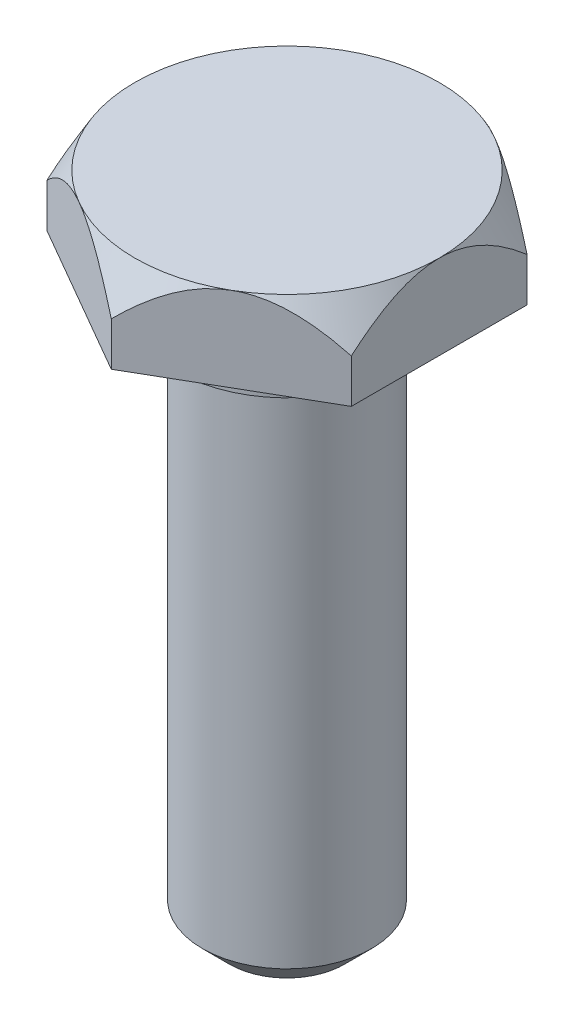
ISO-10303-21;
HEADER;
FILE_DESCRIPTION(('STEP AP214'),'2;1');
FILE_NAME('part.step','',(''),(''),'','','');
FILE_SCHEMA(('AUTOMOTIVE_DESIGN { 1 0 10303 214 1 1 1 1 }'));
ENDSEC;
DATA;
#1=APPLICATION_CONTEXT('core data for automotive mechanical design processes');
#2=APPLICATION_PROTOCOL_DEFINITION('international standard','automotive_design',2000,#1);
#3=PRODUCT_CONTEXT('',#1,'mechanical');
#4=PRODUCT('Part','Part','',(#3));
#5=PRODUCT_RELATED_PRODUCT_CATEGORY('part','',(#4));
#6=PRODUCT_DEFINITION_FORMATION('','',#4);
#7=PRODUCT_DEFINITION_CONTEXT('part definition',#1,'design');
#8=PRODUCT_DEFINITION('design','',#6,#7);
#9=PRODUCT_DEFINITION_SHAPE('','',#8);
#10=(LENGTH_UNIT() NAMED_UNIT(*) SI_UNIT(.MILLI.,.METRE.));
#11=(NAMED_UNIT(*) PLANE_ANGLE_UNIT() SI_UNIT($,.RADIAN.));
#12=(NAMED_UNIT(*) SI_UNIT($,.STERADIAN.) SOLID_ANGLE_UNIT());
#13=UNCERTAINTY_MEASURE_WITH_UNIT(LENGTH_MEASURE(1.E-05),#10,'distance_accuracy_value','');
#14=(GEOMETRIC_REPRESENTATION_CONTEXT(3) GLOBAL_UNCERTAINTY_ASSIGNED_CONTEXT((#13)) GLOBAL_UNIT_ASSIGNED_CONTEXT((#10,
#11,#12)) REPRESENTATION_CONTEXT('',''));
#15=CARTESIAN_POINT('',(0.,0.,0.));
#16=DIRECTION('',(0.,0.,1.));
#17=DIRECTION('',(1.,0.,0.));
#18=AXIS2_PLACEMENT_3D('',#15,#16,#17);
#19=CARTESIAN_POINT('',(0.,-16.,-5.2));
#20=DIRECTION('',(0.499999999999998,0.,-0.86602540378444));
#21=DIRECTION('',(-0.86602540378444,0.,-0.499999999999998));
#22=AXIS2_PLACEMENT_3D('',#19,#20,#21);
#23=PLANE('',#22);
#24=DIRECTION('',(0.,1.,0.));
#25=VECTOR('',#24,1.);
#26=CARTESIAN_POINT('',(0.,-16.,-5.2));
#27=LINE('',#26,#25);
#28=CARTESIAN_POINT('',(0.,1.,-5.2));
#29=VERTEX_POINT('',#28);
#30=CARTESIAN_POINT('',(0.,2.29333580064184,-5.2));
#31=VERTEX_POINT('',#30);
#32=EDGE_CURVE('E143',#29,#31,#27,.T.);
#33=ORIENTED_EDGE('',*,*,#32,.T.);
#34=CARTESIAN_POINT('',(-0.0002,2.29313579398026,-5.20011547005384));
#35=CARTESIAN_POINT('',(0.0469011403824495,2.34023524499869,-5.1729216139749));
#36=CARTESIAN_POINT('',(0.0944722532751612,2.38670654099836,-5.14545641914064));
#37=CARTESIAN_POINT('',(0.190657869442315,2.47821771462454,-5.08992362775436));
#38=CARTESIAN_POINT('',(0.239272666450655,2.52325718018994,-5.061855861615));
#39=CARTESIAN_POINT('',(0.387297987657652,2.65637555293229,-4.97639340256926));
#40=CARTESIAN_POINT('',(0.48841148853874,2.74197068548027,-4.91801549561686));
#41=CARTESIAN_POINT('',(0.698509846250297,2.9065014835554,-4.79671515223579));
#42=CARTESIAN_POINT('',(0.807630576530103,2.98520795102576,-4.73371426923458));
#43=CARTESIAN_POINT('',(1.0317833611979,3.13007672622558,-4.60429959866702));
#44=CARTESIAN_POINT('',(1.14680161058769,3.19626676863727,-4.53789378142011));
#45=CARTESIAN_POINT('',(1.32909810741186,3.2856990070475,-4.43264484990635));
#46=CARTESIAN_POINT('',(1.39424234400745,3.31476608307449,-4.39503380737173));
#47=CARTESIAN_POINT('',(1.52623706753496,3.36726637932291,-4.31882661821152));
#48=CARTESIAN_POINT('',(1.5930876817994,3.39069917773839,-4.28023039807045));
#49=CARTESIAN_POINT('',(1.72769745912124,3.43103513854391,-4.20251340689813));
#50=CARTESIAN_POINT('',(1.79544524039845,3.44798852317885,-4.16339920714073));
#51=CARTESIAN_POINT('',(1.9319604536706,3.4750140875619,-4.08458211200958));
#52=CARTESIAN_POINT('',(2.00072769243193,3.48508755475139,-4.0448793281993));
#53=CARTESIAN_POINT('',(2.13941405326446,3.49801046531967,-3.9648087204397));
#54=CARTESIAN_POINT('',(2.20933795033535,3.50079247425805,-3.92443813964304));
#55=CARTESIAN_POINT('',(2.34910351754793,3.49881816618163,-3.84374445178942));
#56=CARTESIAN_POINT('',(2.41894518797228,3.49406187515646,-3.80342134456926));
#57=CARTESIAN_POINT('',(2.55810932173049,3.47719372164936,-3.72307489448243));
#58=CARTESIAN_POINT('',(2.62743032360903,3.46506586739329,-3.68305239538735));
#59=CARTESIAN_POINT('',(2.76491952502245,3.43393384069037,-3.60367296794065));
#60=CARTESIAN_POINT('',(2.83308700456767,3.41492552820866,-3.56431645527524));
#61=CARTESIAN_POINT('',(3.07412414242066,3.33578563381507,-3.42515359885112));
#62=CARTESIAN_POINT('',(3.24278748842878,3.25803983342103,-3.32777577063091));
#63=CARTESIAN_POINT('',(3.48636672248926,3.1199467145914,-3.18714523427709));
#64=CARTESIAN_POINT('',(3.56619005899107,3.07017543869227,-3.14105920946016));
#65=CARTESIAN_POINT('',(3.72288991210024,2.96475393740493,-3.0505885070856));
#66=CARTESIAN_POINT('',(3.79976691072227,2.90910467928571,-3.00620355123668));
#67=CARTESIAN_POINT('',(3.98593589033841,2.766016402118,-2.89871884074055));
#68=CARTESIAN_POINT('',(4.09364349530401,2.67584560008324,-2.83653382601989));
#69=CARTESIAN_POINT('',(4.25076304037691,2.53547211986548,-2.7458208143771));
#70=CARTESIAN_POINT('',(4.30211777868526,2.48811006848886,-2.71617114239061));
#71=CARTESIAN_POINT('',(4.40366614430005,2.39177691558692,-2.65754216616715));
#72=CARTESIAN_POINT('',(4.45386000936567,2.34280614860675,-2.62856272465984));
#73=CARTESIAN_POINT('',(4.50353209967907,2.29313579398026,-2.59988452994619));
#74=B_SPLINE_CURVE_WITH_KNOTS('',3,(#34,#35,#36,#37,#38,#39,#40,#41,#42,#43,#44,#45,#46,#47,#48,
#49,#50,#51,#52,#53,#54,#55,#56,#57,#58,#59,#60,#61,#62,#63,#64,#65,#66,#67,#68,#69,#70,#71,#72,
#73),.UNSPECIFIED.,.F.,.F.,(4,2,2,2,2,2,2,2,2,2,2,2,2,2,2,2,2,2,2,4),(0.,0.215831451732362,
0.43172446461581,0.865709276716572,1.31090688893008,1.7551061380637,1.9968514743985,
2.23861490318487,2.4784644534946,2.71826910836671,2.96028387577228,3.20229780879056,
3.44483864694657,3.68752566741079,4.31247626233517,4.62662636660601,4.94072485526679,
5.40115685591737,5.62881219046212,5.85642047830151),.UNSPECIFIED.);
#75=CARTESIAN_POINT('',(2.25166604983953,3.5,-3.90000000000002));
#76=VERTEX_POINT('',#75);
#77=EDGE_CURVE('E146',#31,#76,#74,.T.);
#78=ORIENTED_EDGE('',*,*,#77,.T.);
#79=CARTESIAN_POINT('',(4.50333209967907,2.29333580064185,-2.60000000000002));
#80=VERTEX_POINT('',#79);
#81=EDGE_CURVE('E237',#76,#80,#74,.T.);
#82=ORIENTED_EDGE('',*,*,#81,.T.);
#83=DIRECTION('',(0.,1.,0.));
#84=VECTOR('',#83,1.);
#85=CARTESIAN_POINT('',(4.50333209967907,-16.,-2.60000000000003));
#86=LINE('',#85,#84);
#87=CARTESIAN_POINT('',(4.50333209967907,1.,-2.60000000000003));
#88=VERTEX_POINT('',#87);
#89=EDGE_CURVE('E134',#88,#80,#86,.T.);
#90=ORIENTED_EDGE('',*,*,#89,.F.);
#91=DIRECTION('',(-0.86602540378444,0.,-0.499999999999998));
#92=VECTOR('',#91,1.);
#93=CARTESIAN_POINT('',(6.15166604983955,1.,-1.64833395016048));
#94=LINE('',#93,#92);
#95=EDGE_CURVE('E168',#88,#29,#94,.T.);
#96=ORIENTED_EDGE('',*,*,#95,.T.);
#97=EDGE_LOOP('',(#33,#78,#82,#90,#96));
#98=FACE_BOUND('',#97,.T.);
#99=ADVANCED_FACE('F39',(#98),#23,.T.);
#100=CARTESIAN_POINT('',(4.50333209967907,-16.,-2.60000000000003));
#101=DIRECTION('',(1.,0.,0.));
#102=DIRECTION('',(0.,0.,-1.));
#103=AXIS2_PLACEMENT_3D('',#100,#101,#102);
#104=PLANE('',#103);
#105=ORIENTED_EDGE('',*,*,#89,.T.);
#106=CARTESIAN_POINT('',(4.50333209967907,0.216415563066361,-4.54627481097209));
#107=CARTESIAN_POINT('',(4.50333209967907,0.332457435983913,-4.4519528110691));
#108=CARTESIAN_POINT('',(4.50333209967907,0.447813588029783,-4.35677427733934));
#109=CARTESIAN_POINT('',(4.50333209967907,0.676857424368945,-4.16437109343592));
#110=CARTESIAN_POINT('',(4.50333209967907,0.790544655913492,-4.0671459048367));
#111=CARTESIAN_POINT('',(4.50333209967907,1.01694330237538,-3.86944777842779));
#112=CARTESIAN_POINT('',(4.50333209967907,1.12963569947896,-3.7689529945554));
#113=CARTESIAN_POINT('',(4.50333209967907,1.35247917796968,-3.56519775873801));
#114=CARTESIAN_POINT('',(4.50333209967907,1.46263049747441,-3.46193756790757));
#115=CARTESIAN_POINT('',(4.50333209967907,1.68685978340291,-3.24533263391641));
#116=CARTESIAN_POINT('',(4.50333209967907,1.80072709966915,-3.13176882767578));
#117=CARTESIAN_POINT('',(4.50333209967907,2.02392937674397,-2.90018841253913));
#118=CARTESIAN_POINT('',(4.50333209967907,2.13326317518252,-2.78217067631432));
#119=CARTESIAN_POINT('',(4.50333209967907,2.34553429974651,-2.54129878449501));
#120=CARTESIAN_POINT('',(4.50333209967907,2.44849485770499,-2.41846523258464));
#121=CARTESIAN_POINT('',(4.50333209967907,2.64643137681666,-2.16656866624975));
#122=CARTESIAN_POINT('',(4.50333209967907,2.74141276100902,-2.03750997819506));
#123=CARTESIAN_POINT('',(4.50333209967907,2.88957616033856,-1.81790841351126));
#124=CARTESIAN_POINT('',(4.50333209967907,2.94586169475161,-1.72946454076314));
#125=CARTESIAN_POINT('',(4.50333209967907,3.05271330260479,-1.54911809151349));
#126=CARTESIAN_POINT('',(4.50333209967907,3.10327750474313,-1.45721439641566));
#127=CARTESIAN_POINT('',(4.50333209967907,3.1968818280516,-1.27071575109596));
#128=CARTESIAN_POINT('',(4.50333209967907,3.23998963047388,-1.17615518164546));
#129=CARTESIAN_POINT('',(4.50333209967907,3.31774372780694,-0.983653372939059));
#130=CARTESIAN_POINT('',(4.50333209967907,3.35239392816319,-0.885713717972165));
#131=CARTESIAN_POINT('',(4.50333209967907,3.42562431036837,-0.639773318486418));
#132=CARTESIAN_POINT('',(4.50333209967907,3.4583555040521,-0.489940205042256));
#133=CARTESIAN_POINT('',(4.50333209967907,3.4976639657297,-0.186848054091008));
#134=CARTESIAN_POINT('',(4.50333209967907,3.50425478200046,-0.0335908326950485));
#135=CARTESIAN_POINT('',(4.50333209967907,3.49029871500567,0.2716108155052));
#136=CARTESIAN_POINT('',(4.50333209967907,3.46975562400885,0.423555422774915));
#137=CARTESIAN_POINT('',(4.50333209967907,3.40453838787359,0.722136421375482));
#138=CARTESIAN_POINT('',(4.50333209967907,3.35984066908559,0.868767477537573));
#139=CARTESIAN_POINT('',(4.50333209967907,3.26263156711168,1.12487551120467));
#140=CARTESIAN_POINT('',(4.50333209967907,3.213665932093,1.23574866951839));
#141=CARTESIAN_POINT('',(4.50333209967907,3.10613993306368,1.4527900357204));
#142=CARTESIAN_POINT('',(4.50333209967907,3.04757301353044,1.55895496557891));
#143=CARTESIAN_POINT('',(4.50333209967907,2.92223577027134,1.76786853481869));
#144=CARTESIAN_POINT('',(4.50333209967907,2.85538199568495,1.87056649920331));
#145=CARTESIAN_POINT('',(4.50333209967907,2.71569050022903,2.07169900658316));
#146=CARTESIAN_POINT('',(4.50333209967907,2.64285569739026,2.17013559324337));
#147=CARTESIAN_POINT('',(4.50333209967907,2.48589521153302,2.37169646129933));
#148=CARTESIAN_POINT('',(4.50333209967907,2.40133854632997,2.47448316614205));
#149=CARTESIAN_POINT('',(4.50333209967907,2.22781834998086,2.67628382740557));
#150=CARTESIAN_POINT('',(4.50333209967907,2.13885379161291,2.77529689481055));
#151=CARTESIAN_POINT('',(4.50333209967907,1.95734298235729,2.97015736204481));
#152=CARTESIAN_POINT('',(4.50333209967907,1.86479319653053,3.06600145545047));
#153=CARTESIAN_POINT('',(4.50333209967907,1.67686088419095,3.2548779447157));
#154=CARTESIAN_POINT('',(4.50333209967907,1.58147807333761,3.34791005644325));
#155=CARTESIAN_POINT('',(4.50333209967907,1.29087393083653,3.62433701112674));
#156=CARTESIAN_POINT('',(4.50333209967907,1.09215510201806,3.80405474674387));
#157=CARTESIAN_POINT('',(4.50333209967907,0.68830284544034,4.15612387766858));
#158=CARTESIAN_POINT('',(4.50333209967907,0.483168230568449,4.32847389559694));
#159=CARTESIAN_POINT('',(4.50333209967907,0.0889657259078814,4.65052616958507));
#160=CARTESIAN_POINT('',(4.50333209967907,-0.0996604953356007,4.80077112390493));
#161=CARTESIAN_POINT('',(4.50333209967907,-0.479853962026363,5.0975433877512));
#162=CARTESIAN_POINT('',(4.50333209967907,-0.671421661648393,5.24407011371387));
#163=CARTESIAN_POINT('',(4.50333209967907,-1.05445847145293,5.53226888747017));
#164=CARTESIAN_POINT('',(4.50333209967907,-1.24589931149069,5.67397861307399));
#165=CARTESIAN_POINT('',(4.50333209967907,-1.63055330544533,5.954859651152));
#166=CARTESIAN_POINT('',(4.50333209967907,-1.82376594562147,6.09403166652092));
#167=CARTESIAN_POINT('',(4.50333209967907,-2.01768663979484,6.2321953712361));
#168=B_SPLINE_CURVE_WITH_KNOTS('',3,(#106,#107,#108,#109,#110,#111,#112,#113,#114,#115,#116,
#117,#118,#119,#120,#121,#122,#123,#124,#125,#126,#127,#128,#129,#130,#131,#132,#133,#134,#135,
#136,#137,#138,#139,#140,#141,#142,#143,#144,#145,#146,#147,#148,#149,#150,#151,#152,#153,#154,
#155,#156,#157,#158,#159,#160,#161,#162,#163,#164,#165,#166,#167),.UNSPECIFIED.,.F.,.F.,(4,2,2,
2,2,2,2,2,2,2,2,2,2,2,2,2,2,2,2,2,2,2,2,2,2,2,2,2,2,2,4),(0.,0.448629508234905,
0.897378552695795,1.35031690226502,1.80321263435101,2.2855680565207,2.76804639685374,
3.24864754794894,3.7289193707119,4.04325302369259,4.35768919180466,4.66910149058682,
4.98036971609446,5.43838802802684,5.89616892294186,6.35388584459722,6.81205028283173,
7.17514739625493,7.53849346402001,7.90585210848298,8.27303257846788,8.6721677668132,
9.07139641176278,9.47102923792133,9.8707023102328,10.674214751898,11.477876757396,
12.2012694155515,12.9247749142729,13.6393031608499,14.3536303953537),.UNSPECIFIED.);
#169=CARTESIAN_POINT('',(4.50333209967909,3.5,0.));
#170=VERTEX_POINT('',#169);
#171=EDGE_CURVE('E244',#80,#170,#168,.T.);
#172=ORIENTED_EDGE('',*,*,#171,.T.);
#173=CARTESIAN_POINT('',(4.50333209967906,2.29333580064185,2.60000000000003));
#174=VERTEX_POINT('',#173);
#175=EDGE_CURVE('E55',#170,#174,#168,.T.);
#176=ORIENTED_EDGE('',*,*,#175,.T.);
#177=DIRECTION('',(0.,1.,0.));
#178=VECTOR('',#177,1.);
#179=CARTESIAN_POINT('',(4.50333209967907,-16.,2.60000000000003));
#180=LINE('',#179,#178);
#181=CARTESIAN_POINT('',(4.50333209967907,1.,2.60000000000003));
#182=VERTEX_POINT('',#181);
#183=EDGE_CURVE('E131',#182,#174,#180,.T.);
#184=ORIENTED_EDGE('',*,*,#183,.F.);
#185=DIRECTION('',(0.,0.,-1.));
#186=VECTOR('',#185,1.);
#187=CARTESIAN_POINT('',(4.50333209967907,1.,0.));
#188=LINE('',#187,#186);
#189=EDGE_CURVE('E167',#182,#88,#188,.T.);
#190=ORIENTED_EDGE('',*,*,#189,.T.);
#191=EDGE_LOOP('',(#105,#172,#176,#184,#190));
#192=FACE_BOUND('',#191,.T.);
#193=ADVANCED_FACE('F233',(#192),#104,.T.);
#194=CARTESIAN_POINT('',(4.50333209967907,-16.,2.60000000000003));
#195=DIRECTION('',(0.499999999999998,0.,0.86602540378444));
#196=DIRECTION('',(0.86602540378444,0.,-0.499999999999998));
#197=AXIS2_PLACEMENT_3D('',#194,#195,#196);
#198=PLANE('',#197);
#199=ORIENTED_EDGE('',*,*,#183,.T.);
#200=CARTESIAN_POINT('',(4.50353209967907,2.29313579398026,2.59988452994619));
#201=CARTESIAN_POINT('',(4.45643095929662,2.34023524499869,2.62707838602514));
#202=CARTESIAN_POINT('',(4.40885984640391,2.38670654099836,2.65454358085939));
#203=CARTESIAN_POINT('',(4.31267423023675,2.47821771462454,2.71007637224567));
#204=CARTESIAN_POINT('',(4.26405943322841,2.52325718018994,2.73814413838503));
#205=CARTESIAN_POINT('',(4.11603411202142,2.65637555293229,2.82360659743077));
#206=CARTESIAN_POINT('',(4.01492061114033,2.74197068548027,2.88198450438317));
#207=CARTESIAN_POINT('',(3.80482225342877,2.90650148355539,3.00328484776424));
#208=CARTESIAN_POINT('',(3.69570152314897,2.98520795102575,3.06628573076545));
#209=CARTESIAN_POINT('',(3.47154873848117,3.13007672622558,3.19570040133301));
#210=CARTESIAN_POINT('',(3.35653048909138,3.19626676863727,3.26210621857992));
#211=CARTESIAN_POINT('',(3.17423399226721,3.2856990070475,3.36735515009368));
#212=CARTESIAN_POINT('',(3.10908975567162,3.31476608307449,3.4049661926283));
#213=CARTESIAN_POINT('',(2.97709503214411,3.36726637932291,3.48117338178852));
#214=CARTESIAN_POINT('',(2.91024441787967,3.39069917773839,3.51976960192958));
#215=CARTESIAN_POINT('',(2.77563464055783,3.43103513854391,3.5974865931019));
#216=CARTESIAN_POINT('',(2.70788685928062,3.44798852317885,3.6366007928593));
#217=CARTESIAN_POINT('',(2.57137164600847,3.4750140875619,3.71541788799045));
#218=CARTESIAN_POINT('',(2.50260440724714,3.48508755475139,3.75512067180073));
#219=CARTESIAN_POINT('',(2.36391804641461,3.49801046531967,3.83519127956033));
#220=CARTESIAN_POINT('',(2.29399414934372,3.50079247425805,3.87556186035699));
#221=CARTESIAN_POINT('',(2.15422858213114,3.49881816618163,3.95625554821062));
#222=CARTESIAN_POINT('',(2.08438691170679,3.49406187515646,3.99657865543077));
#223=CARTESIAN_POINT('',(1.94522277794858,3.47719372164936,4.07692510551761));
#224=CARTESIAN_POINT('',(1.87590177607004,3.46506586739329,4.11694760461268));
#225=CARTESIAN_POINT('',(1.73841257465662,3.43393384069037,4.19632703205938));
#226=CARTESIAN_POINT('',(1.6702450951114,3.41492552820865,4.23568354472479));
#227=CARTESIAN_POINT('',(1.42920795725841,3.33578563381507,4.37484640114891));
#228=CARTESIAN_POINT('',(1.26054461125029,3.25803983342103,4.47222422936912));
#229=CARTESIAN_POINT('',(1.01696537718981,3.1199467145914,4.61285476572294));
#230=CARTESIAN_POINT('',(0.937142040687999,3.07017543869227,4.65894079053988));
#231=CARTESIAN_POINT('',(0.780442187578828,2.96475393740493,4.74941149291443));
#232=CARTESIAN_POINT('',(0.7035651889568,2.90910467928571,4.79379644876335));
#233=CARTESIAN_POINT('',(0.517396209340663,2.76601640211799,4.90128115925948));
#234=CARTESIAN_POINT('',(0.409688604375055,2.67584560008324,4.96346617398015));
#235=CARTESIAN_POINT('',(0.252569059302163,2.53547211986548,5.05417918562293));
#236=CARTESIAN_POINT('',(0.201214320993815,2.48811006848886,5.08382885760942));
#237=CARTESIAN_POINT('',(0.0996659553790264,2.39177691558692,5.14245783383288));
#238=CARTESIAN_POINT('',(0.0494720903133975,2.34280614860675,5.17143727534019));
#239=CARTESIAN_POINT('',(-0.000199999999997381,2.29313579398026,5.20011547005384));
#240=B_SPLINE_CURVE_WITH_KNOTS('',3,(#200,#201,#202,#203,#204,#205,#206,#207,#208,#209,#210,
#211,#212,#213,#214,#215,#216,#217,#218,#219,#220,#221,#222,#223,#224,#225,#226,#227,#228,#229,
#230,#231,#232,#233,#234,#235,#236,#237,#238,#239),.UNSPECIFIED.,.F.,.F.,(4,2,2,2,2,2,2,2,2,2,2,
2,2,2,2,2,2,2,2,4),(0.,0.215831451732362,0.43172446461581,0.865709276716571,1.31090688893008,
1.7551061380637,1.9968514743985,2.23861490318487,2.4784644534946,2.71826910836671,
2.96028387577228,3.20229780879056,3.44483864694657,3.68752566741079,4.31247626233517,
4.62662636660601,4.94072485526679,5.40115685591737,5.62881219046212,5.85642047830151),.UNSPECIFIED.);
#241=CARTESIAN_POINT('',(2.25166604983954,3.5,3.90000000000002));
#242=VERTEX_POINT('',#241);
#243=EDGE_CURVE('E125',#174,#242,#240,.T.);
#244=ORIENTED_EDGE('',*,*,#243,.T.);
#245=CARTESIAN_POINT('',(0.,2.29333580064185,5.2));
#246=VERTEX_POINT('',#245);
#247=EDGE_CURVE('E62',#242,#246,#240,.T.);
#248=ORIENTED_EDGE('',*,*,#247,.T.);
#249=DIRECTION('',(0.,1.,0.));
#250=VECTOR('',#249,1.);
#251=CARTESIAN_POINT('',(0.,-16.,5.2));
#252=LINE('',#251,#250);
#253=CARTESIAN_POINT('',(0.,1.,5.2));
#254=VERTEX_POINT('',#253);
#255=EDGE_CURVE('E123',#254,#246,#252,.T.);
#256=ORIENTED_EDGE('',*,*,#255,.F.);
#257=DIRECTION('',(0.86602540378444,0.,-0.499999999999998));
#258=VECTOR('',#257,1.);
#259=CARTESIAN_POINT('',(6.15166604983955,1.,1.64833395016048));
#260=LINE('',#259,#258);
#261=EDGE_CURVE('E164',#254,#182,#260,.T.);
#262=ORIENTED_EDGE('',*,*,#261,.T.);
#263=EDGE_LOOP('',(#199,#244,#248,#256,#262));
#264=FACE_BOUND('',#263,.T.);
#265=ADVANCED_FACE('F122',(#264),#198,.T.);
#266=CARTESIAN_POINT('',(0.,-16.,5.2));
#267=DIRECTION('',(-0.499999999999998,0.,0.86602540378444));
#268=DIRECTION('',(0.86602540378444,0.,0.499999999999998));
#269=AXIS2_PLACEMENT_3D('',#266,#267,#268);
#270=PLANE('',#269);
#271=ORIENTED_EDGE('',*,*,#255,.T.);
#272=CARTESIAN_POINT('',(0.000200000000001947,2.29313579398025,5.20011547005384));
#273=CARTESIAN_POINT('',(-0.0469011403824479,2.34023524499869,5.1729216139749));
#274=CARTESIAN_POINT('',(-0.0944722532751595,2.38670654099836,5.14545641914064));
#275=CARTESIAN_POINT('',(-0.190657869442312,2.47821771462454,5.08992362775436));
#276=CARTESIAN_POINT('',(-0.239272666450652,2.52325718018994,5.061855861615));
#277=CARTESIAN_POINT('',(-0.387297987657648,2.65637555293229,4.97639340256926));
#278=CARTESIAN_POINT('',(-0.488411488538737,2.74197068548027,4.91801549561686));
#279=CARTESIAN_POINT('',(-0.698509846250295,2.90650148355539,4.79671515223579));
#280=CARTESIAN_POINT('',(-0.807630576530101,2.98520795102575,4.73371426923458));
#281=CARTESIAN_POINT('',(-1.0317833611979,3.13007672622558,4.60429959866702));
#282=CARTESIAN_POINT('',(-1.14680161058769,3.19626676863727,4.53789378142011));
#283=CARTESIAN_POINT('',(-1.32909810741185,3.2856990070475,4.43264484990635));
#284=CARTESIAN_POINT('',(-1.39424234400744,3.31476608307449,4.39503380737174));
#285=CARTESIAN_POINT('',(-1.52623706753496,3.36726637932291,4.31882661821152));
#286=CARTESIAN_POINT('',(-1.5930876817994,3.39069917773839,4.28023039807045));
#287=CARTESIAN_POINT('',(-1.72769745912123,3.43103513854391,4.20251340689813));
#288=CARTESIAN_POINT('',(-1.79544524039845,3.44798852317885,4.16339920714073));
#289=CARTESIAN_POINT('',(-1.93196045367059,3.4750140875619,4.08458211200958));
#290=CARTESIAN_POINT('',(-2.00072769243193,3.48508755475139,4.0448793281993));
#291=CARTESIAN_POINT('',(-2.13941405326446,3.49801046531967,3.96480872043971));
#292=CARTESIAN_POINT('',(-2.20933795033535,3.50079247425805,3.92443813964304));
#293=CARTESIAN_POINT('',(-2.34910351754793,3.49881816618163,3.84374445178942));
#294=CARTESIAN_POINT('',(-2.41894518797228,3.49406187515646,3.80342134456927));
#295=CARTESIAN_POINT('',(-2.55810932173048,3.47719372164937,3.72307489448243));
#296=CARTESIAN_POINT('',(-2.62743032360903,3.46506586739329,3.68305239538735));
#297=CARTESIAN_POINT('',(-2.76491952502245,3.43393384069038,3.60367296794065));
#298=CARTESIAN_POINT('',(-2.83308700456767,3.41492552820866,3.56431645527524));
#299=CARTESIAN_POINT('',(-3.07412414242066,3.33578563381507,3.42515359885112));
#300=CARTESIAN_POINT('',(-3.24278748842878,3.25803983342103,3.32777577063091));
#301=CARTESIAN_POINT('',(-3.48636672248925,3.11994671459141,3.18714523427709));
#302=CARTESIAN_POINT('',(-3.56619005899107,3.07017543869228,3.14105920946016));
#303=CARTESIAN_POINT('',(-3.72288991210024,2.96475393740494,3.0505885070856));
#304=CARTESIAN_POINT('',(-3.79976691072227,2.90910467928571,3.00620355123668));
#305=CARTESIAN_POINT('',(-3.9859358903384,2.766016402118,2.89871884074055));
#306=CARTESIAN_POINT('',(-4.09364349530401,2.67584560008324,2.83653382601989));
#307=CARTESIAN_POINT('',(-4.2507630403769,2.53547211986548,2.7458208143771));
#308=CARTESIAN_POINT('',(-4.30211777868525,2.48811006848887,2.71617114239061));
#309=CARTESIAN_POINT('',(-4.40366614430004,2.39177691558693,2.65754216616715));
#310=CARTESIAN_POINT('',(-4.45386000936567,2.34280614860675,2.62856272465984));
#311=CARTESIAN_POINT('',(-4.50353209967907,2.29313579398026,2.59988452994619));
#312=B_SPLINE_CURVE_WITH_KNOTS('',3,(#272,#273,#274,#275,#276,#277,#278,#279,#280,#281,#282,
#283,#284,#285,#286,#287,#288,#289,#290,#291,#292,#293,#294,#295,#296,#297,#298,#299,#300,#301,
#302,#303,#304,#305,#306,#307,#308,#309,#310,#311),.UNSPECIFIED.,.F.,.F.,(4,2,2,2,2,2,2,2,2,2,2,
2,2,2,2,2,2,2,2,4),(0.,0.215831451732362,0.431724464615811,0.865709276716571,1.31090688893008,
1.7551061380637,1.9968514743985,2.23861490318487,2.4784644534946,2.71826910836671,
2.96028387577228,3.20229780879056,3.44483864694657,3.68752566741079,4.31247626233517,
4.62662636660601,4.94072485526679,5.40115685591737,5.62881219046212,5.85642047830151),.UNSPECIFIED.);
#313=CARTESIAN_POINT('',(-2.25166604983953,3.5,3.90000000000002));
#314=VERTEX_POINT('',#313);
#315=EDGE_CURVE('E109',#246,#314,#312,.T.);
#316=ORIENTED_EDGE('',*,*,#315,.T.);
#317=CARTESIAN_POINT('',(-4.50333209967907,2.29333580064185,2.60000000000003));
#318=VERTEX_POINT('',#317);
#319=EDGE_CURVE('E116',#314,#318,#312,.T.);
#320=ORIENTED_EDGE('',*,*,#319,.T.);
#321=DIRECTION('',(0.,1.,0.));
#322=VECTOR('',#321,1.);
#323=CARTESIAN_POINT('',(-4.50333209967907,-16.,2.60000000000003));
#324=LINE('',#323,#322);
#325=CARTESIAN_POINT('',(-4.50333209967907,1.,2.60000000000003));
#326=VERTEX_POINT('',#325);
#327=EDGE_CURVE('E132',#326,#318,#324,.T.);
#328=ORIENTED_EDGE('',*,*,#327,.F.);
#329=DIRECTION('',(0.86602540378444,0.,0.499999999999998));
#330=VECTOR('',#329,1.);
#331=CARTESIAN_POINT('',(1.64833395016048,1.,6.15166604983955));
#332=LINE('',#331,#330);
#333=EDGE_CURVE('E130',#326,#254,#332,.T.);
#334=ORIENTED_EDGE('',*,*,#333,.T.);
#335=EDGE_LOOP('',(#271,#316,#320,#328,#334));
#336=FACE_BOUND('',#335,.T.);
#337=ADVANCED_FACE('F127',(#336),#270,.T.);
#338=CARTESIAN_POINT('',(-4.50333209967907,-16.,2.60000000000003));
#339=DIRECTION('',(-1.,0.,0.));
#340=DIRECTION('',(0.,0.,1.));
#341=AXIS2_PLACEMENT_3D('',#338,#339,#340);
#342=PLANE('',#341);
#343=ORIENTED_EDGE('',*,*,#327,.T.);
#344=CARTESIAN_POINT('',(-4.50333209967907,0.216415563066348,-4.5462748109721));
#345=CARTESIAN_POINT('',(-4.50333209967907,0.3324574359839,-4.45195281106912));
#346=CARTESIAN_POINT('',(-4.50333209967907,0.44781358802977,-4.35677427733936));
#347=CARTESIAN_POINT('',(-4.50333209967907,0.676857424368934,-4.16437109343593));
#348=CARTESIAN_POINT('',(-4.50333209967907,0.790544655913481,-4.06714590483671));
#349=CARTESIAN_POINT('',(-4.50333209967907,1.01694330237537,-3.8694477784278));
#350=CARTESIAN_POINT('',(-4.50333209967907,1.12963569947896,-3.76895299455541));
#351=CARTESIAN_POINT('',(-4.50333209967907,1.35247917796967,-3.56519775873802));
#352=CARTESIAN_POINT('',(-4.50333209967907,1.4626304974744,-3.46193756790758));
#353=CARTESIAN_POINT('',(-4.50333209967907,1.68685978340291,-3.24533263391642));
#354=CARTESIAN_POINT('',(-4.50333209967907,1.80072709966914,-3.13176882767579));
#355=CARTESIAN_POINT('',(-4.50333209967907,2.02392937674397,-2.90018841253914));
#356=CARTESIAN_POINT('',(-4.50333209967907,2.13326317518252,-2.78217067631433));
#357=CARTESIAN_POINT('',(-4.50333209967907,2.34553429974651,-2.54129878449502));
#358=CARTESIAN_POINT('',(-4.50333209967907,2.44849485770499,-2.41846523258465));
#359=CARTESIAN_POINT('',(-4.50333209967907,2.64643137681666,-2.16656866624976));
#360=CARTESIAN_POINT('',(-4.50333209967907,2.74141276100902,-2.03750997819507));
#361=CARTESIAN_POINT('',(-4.50333209967907,2.88957616033856,-1.81790841351127));
#362=CARTESIAN_POINT('',(-4.50333209967907,2.94586169475161,-1.72946454076315));
#363=CARTESIAN_POINT('',(-4.50333209967907,3.0527133026048,-1.5491180915135));
#364=CARTESIAN_POINT('',(-4.50333209967907,3.10327750474313,-1.45721439641567));
#365=CARTESIAN_POINT('',(-4.50333209967907,3.1968818280516,-1.27071575109596));
#366=CARTESIAN_POINT('',(-4.50333209967907,3.23998963047388,-1.17615518164546));
#367=CARTESIAN_POINT('',(-4.50333209967907,3.31774372780694,-0.983653372939063));
#368=CARTESIAN_POINT('',(-4.50333209967907,3.35239392816319,-0.885713717972168));
#369=CARTESIAN_POINT('',(-4.50333209967907,3.42562431036838,-0.639773318486422));
#370=CARTESIAN_POINT('',(-4.50333209967907,3.4583555040521,-0.48994020504226));
#371=CARTESIAN_POINT('',(-4.50333209967907,3.4976639657297,-0.186848054091012));
#372=CARTESIAN_POINT('',(-4.50333209967907,3.50425478200046,-0.0335908326950524));
#373=CARTESIAN_POINT('',(-4.50333209967907,3.49029871500567,0.271610815505197));
#374=CARTESIAN_POINT('',(-4.50333209967907,3.46975562400886,0.423555422774911));
#375=CARTESIAN_POINT('',(-4.50333209967907,3.40453838787359,0.722136421375478));
#376=CARTESIAN_POINT('',(-4.50333209967907,3.35984066908559,0.86876747753757));
#377=CARTESIAN_POINT('',(-4.50333209967907,3.26263156711168,1.12487551120467));
#378=CARTESIAN_POINT('',(-4.50333209967907,3.213665932093,1.23574866951839));
#379=CARTESIAN_POINT('',(-4.50333209967907,3.10613993306369,1.4527900357204));
#380=CARTESIAN_POINT('',(-4.50333209967907,3.04757301353045,1.55895496557891));
#381=CARTESIAN_POINT('',(-4.50333209967907,2.92223577027135,1.76786853481868));
#382=CARTESIAN_POINT('',(-4.50333209967907,2.85538199568496,1.87056649920331));
#383=CARTESIAN_POINT('',(-4.50333209967907,2.71569050022903,2.07169900658315));
#384=CARTESIAN_POINT('',(-4.50333209967907,2.64285569739027,2.17013559324337));
#385=CARTESIAN_POINT('',(-4.50333209967907,2.48589521153303,2.37169646129932));
#386=CARTESIAN_POINT('',(-4.50333209967907,2.40133854632998,2.47448316614204));
#387=CARTESIAN_POINT('',(-4.50333209967907,2.22781834998088,2.67628382740557));
#388=CARTESIAN_POINT('',(-4.50333209967907,2.13885379161292,2.77529689481054));
#389=CARTESIAN_POINT('',(-4.50333209967907,1.9573429823573,2.9701573620448));
#390=CARTESIAN_POINT('',(-4.50333209967907,1.86479319653055,3.06600145545046));
#391=CARTESIAN_POINT('',(-4.50333209967907,1.67686088419096,3.25487794471569));
#392=CARTESIAN_POINT('',(-4.50333209967907,1.58147807333762,3.34791005644324));
#393=CARTESIAN_POINT('',(-4.50333209967907,1.29087393083655,3.62433701112673));
#394=CARTESIAN_POINT('',(-4.50333209967907,1.09215510201808,3.80405474674386));
#395=CARTESIAN_POINT('',(-4.50333209967907,0.68830284544036,4.15612387766857));
#396=CARTESIAN_POINT('',(-4.50333209967907,0.48316823056847,4.32847389559693));
#397=CARTESIAN_POINT('',(-4.50333209967907,0.0889657259079046,4.65052616958505));
#398=CARTESIAN_POINT('',(-4.50333209967907,-0.0996604953355764,4.80077112390491));
#399=CARTESIAN_POINT('',(-4.50333209967907,-0.479853962026337,5.09754338775118));
#400=CARTESIAN_POINT('',(-4.50333209967907,-0.671421661648366,5.24407011371385));
#401=CARTESIAN_POINT('',(-4.50333209967907,-1.0544584714529,5.53226888747016));
#402=CARTESIAN_POINT('',(-4.50333209967907,-1.24589931149066,5.67397861307397));
#403=CARTESIAN_POINT('',(-4.50333209967907,-1.6305533054453,5.95485965115198));
#404=CARTESIAN_POINT('',(-4.50333209967907,-1.82376594562144,6.0940316665209));
#405=CARTESIAN_POINT('',(-4.50333209967907,-2.01768663979481,6.23219537123608));
#406=B_SPLINE_CURVE_WITH_KNOTS('',3,(#344,#345,#346,#347,#348,#349,#350,#351,#352,#353,#354,
#355,#356,#357,#358,#359,#360,#361,#362,#363,#364,#365,#366,#367,#368,#369,#370,#371,#372,#373,
#374,#375,#376,#377,#378,#379,#380,#381,#382,#383,#384,#385,#386,#387,#388,#389,#390,#391,#392,
#393,#394,#395,#396,#397,#398,#399,#400,#401,#402,#403,#404,#405),.UNSPECIFIED.,.F.,.F.,(4,2,2,
2,2,2,2,2,2,2,2,2,2,2,2,2,2,2,2,2,2,2,2,2,2,2,2,2,2,2,4),(0.,0.448629508234907,
0.897378552695799,1.35031690226503,1.80321263435101,2.28556805652071,2.76804639685375,
3.24864754794896,3.72891937071191,4.04325302369261,4.35768919180468,4.66910149058684,
4.98036971609448,5.43838802802686,5.89616892294188,6.35388584459724,6.81205028283175,
7.17514739625496,7.53849346402003,7.90585210848299,8.27303257846789,8.67216776681322,
9.07139641176279,9.47102923792134,9.87070231023281,10.674214751898,11.477876757396,
12.2012694155515,12.9247749142729,13.6393031608499,14.3536303953537),.UNSPECIFIED.);
#407=CARTESIAN_POINT('',(-4.50333209967909,3.5,0.));
#408=VERTEX_POINT('',#407);
#409=EDGE_CURVE('E187',#318,#408,#406,.F.);
#410=ORIENTED_EDGE('',*,*,#409,.T.);
#411=CARTESIAN_POINT('',(-4.50333209967906,2.29333580064185,-2.60000000000004));
#412=VERTEX_POINT('',#411);
#413=EDGE_CURVE('E194',#408,#412,#406,.F.);
#414=ORIENTED_EDGE('',*,*,#413,.T.);
#415=DIRECTION('',(0.,1.,0.));
#416=VECTOR('',#415,1.);
#417=CARTESIAN_POINT('',(-4.50333209967907,-16.,-2.60000000000003));
#418=LINE('',#417,#416);
#419=CARTESIAN_POINT('',(-4.50333209967907,1.,-2.60000000000003));
#420=VERTEX_POINT('',#419);
#421=EDGE_CURVE('E137',#420,#412,#418,.T.);
#422=ORIENTED_EDGE('',*,*,#421,.F.);
#423=DIRECTION('',(0.,0.,1.));
#424=VECTOR('',#423,1.);
#425=CARTESIAN_POINT('',(-4.50333209967907,1.,0.));
#426=LINE('',#425,#424);
#427=EDGE_CURVE('E160',#420,#326,#426,.T.);
#428=ORIENTED_EDGE('',*,*,#427,.T.);
#429=EDGE_LOOP('',(#343,#410,#414,#422,#428));
#430=FACE_BOUND('',#429,.T.);
#431=ADVANCED_FACE('F192',(#430),#342,.T.);
#432=CARTESIAN_POINT('',(-4.50333209967907,-16.,-2.60000000000003));
#433=DIRECTION('',(-0.499999999999997,0.,-0.866025403784441));
#434=DIRECTION('',(-0.866025403784441,0.,0.499999999999997));
#435=AXIS2_PLACEMENT_3D('',#432,#433,#434);
#436=PLANE('',#435);
#437=ORIENTED_EDGE('',*,*,#421,.T.);
#438=CARTESIAN_POINT('',(-4.50353209967907,2.29313579398025,-2.5998845299462));
#439=CARTESIAN_POINT('',(-4.45643095929662,2.34023524499869,-2.62707838602514));
#440=CARTESIAN_POINT('',(-4.4088598464039,2.38670654099835,-2.6545435808594));
#441=CARTESIAN_POINT('',(-4.31267423023675,2.47821771462454,-2.71007637224567));
#442=CARTESIAN_POINT('',(-4.26405943322841,2.52325718018994,-2.73814413838504));
#443=CARTESIAN_POINT('',(-4.11603411202141,2.65637555293229,-2.82360659743078));
#444=CARTESIAN_POINT('',(-4.01492061114033,2.74197068548027,-2.88198450438318));
#445=CARTESIAN_POINT('',(-3.80482225342877,2.90650148355539,-3.00328484776424));
#446=CARTESIAN_POINT('',(-3.69570152314896,2.98520795102575,-3.06628573076546));
#447=CARTESIAN_POINT('',(-3.47154873848116,3.13007672622558,-3.19570040133302));
#448=CARTESIAN_POINT('',(-3.35653048909138,3.19626676863727,-3.26210621857993));
#449=CARTESIAN_POINT('',(-3.17423399226721,3.2856990070475,-3.36735515009369));
#450=CARTESIAN_POINT('',(-3.10908975567162,3.31476608307449,-3.4049661926283));
#451=CARTESIAN_POINT('',(-2.97709503214411,3.36726637932291,-3.48117338178852));
#452=CARTESIAN_POINT('',(-2.91024441787967,3.39069917773839,-3.51976960192959));
#453=CARTESIAN_POINT('',(-2.77563464055783,3.43103513854391,-3.5974865931019));
#454=CARTESIAN_POINT('',(-2.70788685928061,3.44798852317885,-3.6366007928593));
#455=CARTESIAN_POINT('',(-2.57137164600847,3.4750140875619,-3.71541788799045));
#456=CARTESIAN_POINT('',(-2.50260440724713,3.48508755475139,-3.75512067180074));
#457=CARTESIAN_POINT('',(-2.3639180464146,3.49801046531966,-3.83519127956033));
#458=CARTESIAN_POINT('',(-2.29399414934371,3.50079247425805,-3.875561860357));
#459=CARTESIAN_POINT('',(-2.15422858213113,3.49881816618163,-3.95625554821062));
#460=CARTESIAN_POINT('',(-2.08438691170678,3.49406187515646,-3.99657865543077));
#461=CARTESIAN_POINT('',(-1.94522277794858,3.47719372164936,-4.07692510551761));
#462=CARTESIAN_POINT('',(-1.87590177607003,3.46506586739328,-4.11694760461268));
#463=CARTESIAN_POINT('',(-1.73841257465661,3.43393384069037,-4.19632703205938));
#464=CARTESIAN_POINT('',(-1.67024509511139,3.41492552820865,-4.2356835447248));
#465=CARTESIAN_POINT('',(-1.4292079572584,3.33578563381506,-4.37484640114892));
#466=CARTESIAN_POINT('',(-1.26054461125028,3.25803983342103,-4.47222422936913));
#467=CARTESIAN_POINT('',(-1.01696537718981,3.1199467145914,-4.61285476572294));
#468=CARTESIAN_POINT('',(-0.937142040687992,3.07017543869227,-4.65894079053988));
#469=CARTESIAN_POINT('',(-0.780442187578821,2.96475393740493,-4.74941149291443));
#470=CARTESIAN_POINT('',(-0.703565188956793,2.90910467928571,-4.79379644876335));
#471=CARTESIAN_POINT('',(-0.517396209340656,2.76601640211799,-4.90128115925948));
#472=CARTESIAN_POINT('',(-0.40968860437505,2.67584560008324,-4.96346617398015));
#473=CARTESIAN_POINT('',(-0.252569059302159,2.53547211986548,-5.05417918562293));
#474=CARTESIAN_POINT('',(-0.201214320993811,2.48811006848886,-5.08382885760942));
#475=CARTESIAN_POINT('',(-0.0996659553790235,2.39177691558692,-5.14245783383288));
#476=CARTESIAN_POINT('',(-0.0494720903133948,2.34280614860675,-5.17143727534019));
#477=CARTESIAN_POINT('',(0.00019999999999974,2.29313579398026,-5.20011547005384));
#478=B_SPLINE_CURVE_WITH_KNOTS('',3,(#438,#439,#440,#441,#442,#443,#444,#445,#446,#447,#448,
#449,#450,#451,#452,#453,#454,#455,#456,#457,#458,#459,#460,#461,#462,#463,#464,#465,#466,#467,
#468,#469,#470,#471,#472,#473,#474,#475,#476,#477),.UNSPECIFIED.,.F.,.F.,(4,2,2,2,2,2,2,2,2,2,2,
2,2,2,2,2,2,2,2,4),(0.,0.215831451732363,0.431724464615812,0.865709276716571,1.31090688893008,
1.7551061380637,1.9968514743985,2.23861490318487,2.4784644534946,2.71826910836671,
2.96028387577228,3.20229780879056,3.44483864694657,3.68752566741079,4.31247626233517,
4.62662636660601,4.9407248552668,5.40115685591737,5.62881219046212,5.8564204783015),.UNSPECIFIED.);
#479=CARTESIAN_POINT('',(-2.25166604983953,3.5,-3.90000000000002));
#480=VERTEX_POINT('',#479);
#481=EDGE_CURVE('E196',#412,#480,#478,.T.);
#482=ORIENTED_EDGE('',*,*,#481,.T.);
#483=EDGE_CURVE('E204',#480,#31,#478,.T.);
#484=ORIENTED_EDGE('',*,*,#483,.T.);
#485=ORIENTED_EDGE('',*,*,#32,.F.);
#486=DIRECTION('',(-0.866025403784441,0.,0.499999999999997));
#487=VECTOR('',#486,1.);
#488=CARTESIAN_POINT('',(1.64833395016049,1.,-6.15166604983955));
#489=LINE('',#488,#487);
#490=EDGE_CURVE('E157',#29,#420,#489,.T.);
#491=ORIENTED_EDGE('',*,*,#490,.T.);
#492=EDGE_LOOP('',(#437,#482,#484,#485,#491));
#493=FACE_BOUND('',#492,.T.);
#494=ADVANCED_FACE('F222',(#493),#436,.T.);
#495=CARTESIAN_POINT('',(5.2,1.,0.));
#496=DIRECTION('',(0.,1.,0.));
#497=DIRECTION('',(0.,0.,1.));
#498=AXIS2_PLACEMENT_3D('',#495,#496,#497);
#499=PLANE('',#498);
#500=CARTESIAN_POINT('',(0.,1.,0.));
#501=DIRECTION('',(0.,1.,0.));
#502=DIRECTION('',(0.,0.,1.));
#503=AXIS2_PLACEMENT_3D('',#500,#501,#502);
#504=CIRCLE('',#503,3.3);
#505=CARTESIAN_POINT('',(0.,1.,3.3));
#506=VERTEX_POINT('',#505);
#507=EDGE_CURVE('E154',#506,#506,#504,.T.);
#508=ORIENTED_EDGE('',*,*,#507,.T.);
#509=EDGE_LOOP('',(#508));
#510=FACE_BOUND('',#509,.T.);
#511=ORIENTED_EDGE('',*,*,#95,.F.);
#512=ORIENTED_EDGE('',*,*,#189,.F.);
#513=ORIENTED_EDGE('',*,*,#261,.F.);
#514=ORIENTED_EDGE('',*,*,#333,.F.);
#515=ORIENTED_EDGE('',*,*,#427,.F.);
#516=ORIENTED_EDGE('',*,*,#490,.F.);
#517=EDGE_LOOP('',(#511,#512,#513,#514,#515,#516));
#518=FACE_BOUND('',#517,.T.);
#519=ADVANCED_FACE('F228',(#510,#518),#499,.F.);
#520=CARTESIAN_POINT('',(0.,35.7888692579505,0.));
#521=DIRECTION('',(0.,1.,0.));
#522=DIRECTION('',(0.,0.,1.));
#523=AXIS2_PLACEMENT_3D('',#520,#521,#522);
#524=CYLINDRICAL_SURFACE('',#523,3.3);
#525=ORIENTED_EDGE('',*,*,#507,.F.);
#526=EDGE_LOOP('',(#525));
#527=FACE_BOUND('',#526,.T.);
#528=CARTESIAN_POINT('',(0.,0.,0.));
#529=DIRECTION('',(0.,1.,0.));
#530=DIRECTION('',(0.,0.,1.));
#531=AXIS2_PLACEMENT_3D('',#528,#529,#530);
#532=CIRCLE('',#531,3.3);
#533=CARTESIAN_POINT('',(0.,0.,3.3));
#534=VERTEX_POINT('',#533);
#535=EDGE_CURVE('E150',#534,#534,#532,.T.);
#536=ORIENTED_EDGE('',*,*,#535,.T.);
#537=EDGE_LOOP('',(#536));
#538=FACE_BOUND('',#537,.T.);
#539=ADVANCED_FACE('F295',(#527,#538),#524,.T.);
#540=CARTESIAN_POINT('',(3.3,0.,0.));
#541=DIRECTION('',(0.,1.,0.));
#542=DIRECTION('',(0.,0.,1.));
#543=AXIS2_PLACEMENT_3D('',#540,#541,#542);
#544=PLANE('',#543);
#545=ORIENTED_EDGE('',*,*,#535,.F.);
#546=EDGE_LOOP('',(#545));
#547=FACE_BOUND('',#546,.T.);
#548=CARTESIAN_POINT('',(0.,0.,0.));
#549=DIRECTION('',(0.,1.,0.));
#550=DIRECTION('',(0.,0.,1.));
#551=AXIS2_PLACEMENT_3D('',#548,#549,#550);
#552=CIRCLE('',#551,2.49990000000001);
#553=CARTESIAN_POINT('',(0.,0.,2.49990000000001));
#554=VERTEX_POINT('',#553);
#555=EDGE_CURVE('E447',#554,#554,#552,.T.);
#556=ORIENTED_EDGE('',*,*,#555,.T.);
#557=EDGE_LOOP('',(#556));
#558=FACE_BOUND('',#557,.T.);
#559=ADVANCED_FACE('F303',(#547,#558),#544,.F.);
#560=CARTESIAN_POINT('',(0.,3.5,0.));
#561=DIRECTION('',(0.,-1.,0.));
#562=DIRECTION('',(0.,0.,-1.));
#563=AXIS2_PLACEMENT_3D('',#560,#561,#562);
#564=CONICAL_SURFACE('',#563,4.50333209967909,0.523598775598296);
#565=ORIENTED_EDGE('',*,*,#483,.F.);
#566=CARTESIAN_POINT('',(0.,3.5,0.));
#567=DIRECTION('',(0.,-1.,0.));
#568=DIRECTION('',(0.,0.,-1.));
#569=AXIS2_PLACEMENT_3D('',#566,#567,#568);
#570=CIRCLE('',#569,4.50333209967909);
#571=EDGE_CURVE('E43',#480,#76,#570,.T.);
#572=ORIENTED_EDGE('',*,*,#571,.T.);
#573=ORIENTED_EDGE('',*,*,#77,.F.);
#574=EDGE_LOOP('',(#565,#572,#573));
#575=FACE_BOUND('',#574,.T.);
#576=ADVANCED_FACE('F313',(#575),#564,.T.);
#577=EDGE_CURVE('E175',#408,#480,#570,.T.);
#578=ORIENTED_EDGE('',*,*,#577,.T.);
#579=ORIENTED_EDGE('',*,*,#481,.F.);
#580=ORIENTED_EDGE('',*,*,#413,.F.);
#581=EDGE_LOOP('',(#578,#579,#580));
#582=FACE_BOUND('',#581,.T.);
#583=ADVANCED_FACE('F216',(#582),#564,.T.);
#584=EDGE_CURVE('E180',#314,#408,#570,.T.);
#585=ORIENTED_EDGE('',*,*,#584,.T.);
#586=ORIENTED_EDGE('',*,*,#409,.F.);
#587=ORIENTED_EDGE('',*,*,#319,.F.);
#588=EDGE_LOOP('',(#585,#586,#587));
#589=FACE_BOUND('',#588,.T.);
#590=ADVANCED_FACE('F185',(#589),#564,.T.);
#591=EDGE_CURVE('E48',#242,#314,#570,.T.);
#592=ORIENTED_EDGE('',*,*,#591,.T.);
#593=ORIENTED_EDGE('',*,*,#315,.F.);
#594=ORIENTED_EDGE('',*,*,#247,.F.);
#595=EDGE_LOOP('',(#592,#593,#594));
#596=FACE_BOUND('',#595,.T.);
#597=ADVANCED_FACE('F110',(#596),#564,.T.);
#598=CARTESIAN_POINT('',(0.,3.5,0.));
#599=DIRECTION('',(0.,1.,0.));
#600=DIRECTION('',(0.,0.,1.));
#601=AXIS2_PLACEMENT_3D('',#598,#599,#600);
#602=CIRCLE('',#601,4.50333209967909);
#603=EDGE_CURVE('E451',#242,#170,#602,.T.);
#604=ORIENTED_EDGE('',*,*,#603,.F.);
#605=ORIENTED_EDGE('',*,*,#243,.F.);
#606=ORIENTED_EDGE('',*,*,#175,.F.);
#607=EDGE_LOOP('',(#604,#605,#606));
#608=FACE_BOUND('',#607,.T.);
#609=ADVANCED_FACE('F337',(#608),#564,.T.);
#610=EDGE_CURVE('E11',#76,#170,#570,.T.);
#611=ORIENTED_EDGE('',*,*,#610,.T.);
#612=ORIENTED_EDGE('',*,*,#171,.F.);
#613=ORIENTED_EDGE('',*,*,#81,.F.);
#614=EDGE_LOOP('',(#611,#612,#613));
#615=FACE_BOUND('',#614,.T.);
#616=ADVANCED_FACE('F321',(#615),#564,.T.);
#617=CARTESIAN_POINT('',(0.,3.5,0.));
#618=DIRECTION('',(0.,-1.,0.));
#619=DIRECTION('',(0.,0.,-1.));
#620=AXIS2_PLACEMENT_3D('',#617,#618,#619);
#621=PLANE('',#620);
#622=ORIENTED_EDGE('',*,*,#610,.F.);
#623=ORIENTED_EDGE('',*,*,#571,.F.);
#624=ORIENTED_EDGE('',*,*,#577,.F.);
#625=ORIENTED_EDGE('',*,*,#584,.F.);
#626=ORIENTED_EDGE('',*,*,#591,.F.);
#627=ORIENTED_EDGE('',*,*,#603,.T.);
#628=EDGE_LOOP('',(#622,#623,#624,#625,#626,#627));
#629=FACE_BOUND('',#628,.T.);
#630=ADVANCED_FACE('F41',(#629),#621,.F.);
#631=CARTESIAN_POINT('',(0.,10.4311761253964,0.));
#632=DIRECTION('',(0.,1.,0.));
#633=DIRECTION('',(0.,0.,1.));
#634=AXIS2_PLACEMENT_3D('',#631,#632,#633);
#635=CYLINDRICAL_SURFACE('',#634,2.49990000000001);
#636=CARTESIAN_POINT('',(0.,-15.2,0.));
#637=DIRECTION('',(0.,1.,0.));
#638=DIRECTION('',(0.,0.,1.));
#639=AXIS2_PLACEMENT_3D('',#636,#637,#638);
#640=CIRCLE('',#639,2.49990000000001);
#641=CARTESIAN_POINT('',(0.,-15.2,2.49990000000001));
#642=VERTEX_POINT('',#641);
#643=EDGE_CURVE('E443',#642,#642,#640,.T.);
#644=ORIENTED_EDGE('',*,*,#643,.T.);
#645=EDGE_LOOP('',(#644));
#646=FACE_BOUND('',#645,.T.);
#647=ORIENTED_EDGE('',*,*,#555,.F.);
#648=EDGE_LOOP('',(#647));
#649=FACE_BOUND('',#648,.T.);
#650=ADVANCED_FACE('F354',(#646,#649),#635,.T.);
#651=CARTESIAN_POINT('',(2.50000000000001,-15.2,0.));
#652=DIRECTION('',(0.,1.,0.));
#653=DIRECTION('',(0.,0.,1.));
#654=AXIS2_PLACEMENT_3D('',#651,#652,#653);
#655=PLANE('',#654);
#656=CARTESIAN_POINT('',(0.,-15.2,0.));
#657=DIRECTION('',(0.,1.,0.));
#658=DIRECTION('',(0.,0.,1.));
#659=AXIS2_PLACEMENT_3D('',#656,#657,#658);
#660=CIRCLE('',#659,2.50000000000001);
#661=CARTESIAN_POINT('',(0.,-15.2,2.50000000000001));
#662=VERTEX_POINT('',#661);
#663=EDGE_CURVE('E441',#662,#662,#660,.T.);
#664=ORIENTED_EDGE('',*,*,#663,.T.);
#665=EDGE_LOOP('',(#664));
#666=FACE_BOUND('',#665,.T.);
#667=ORIENTED_EDGE('',*,*,#643,.F.);
#668=EDGE_LOOP('',(#667));
#669=FACE_BOUND('',#668,.T.);
#670=ADVANCED_FACE('F359',(#666,#669),#655,.T.);
#671=CARTESIAN_POINT('',(1.70000000000001,-16.,0.));
#672=DIRECTION('',(0.,1.,0.));
#673=DIRECTION('',(0.,0.,1.));
#674=AXIS2_PLACEMENT_3D('',#671,#672,#673);
#675=PLANE('',#674);
#676=CARTESIAN_POINT('',(0.,-16.,0.));
#677=DIRECTION('',(0.,1.,0.));
#678=DIRECTION('',(0.,0.,1.));
#679=AXIS2_PLACEMENT_3D('',#676,#677,#678);
#680=CIRCLE('',#679,1.70000000000001);
#681=CARTESIAN_POINT('',(0.,-16.,1.70000000000001));
#682=VERTEX_POINT('',#681);
#683=EDGE_CURVE('E147',#682,#682,#680,.T.);
#684=ORIENTED_EDGE('',*,*,#683,.F.);
#685=EDGE_LOOP('',(#684));
#686=FACE_BOUND('',#685,.T.);
#687=ADVANCED_FACE('F234',(#686),#675,.F.);
#688=CARTESIAN_POINT('',(0.,-16.,0.));
#689=DIRECTION('',(0.,1.,0.));
#690=DIRECTION('',(0.,0.,1.));
#691=AXIS2_PLACEMENT_3D('',#688,#689,#690);
#692=CONICAL_SURFACE('',#691,1.70000000000001,0.785398163397447);
#693=ORIENTED_EDGE('',*,*,#663,.F.);
#694=EDGE_LOOP('',(#693));
#695=FACE_BOUND('',#694,.T.);
#696=ORIENTED_EDGE('',*,*,#683,.T.);
#697=EDGE_LOOP('',(#696));
#698=FACE_BOUND('',#697,.T.);
#699=ADVANCED_FACE('F372',(#695,#698),#692,.T.);
#700=CLOSED_SHELL('',(#99,#193,#265,#337,#431,#494,#519,#539,#559,#576,#583,#590,#597,#609,#616,
#630,#650,#670,#687,#699));
#701=MANIFOLD_SOLID_BREP('B2',#700);
#702=ADVANCED_BREP_SHAPE_REPRESENTATION('',(#18,#701),#14);
#703=SHAPE_DEFINITION_REPRESENTATION(#9,#702);
ENDSEC;
END-ISO-10303-21;
